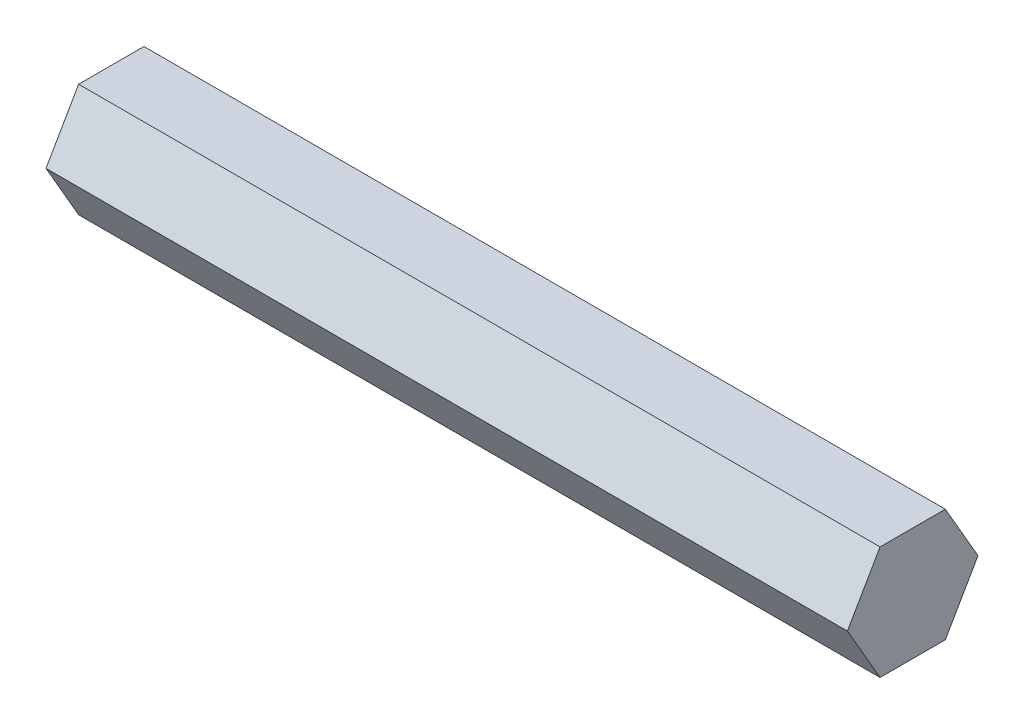
ISO-10303-21;
HEADER;
FILE_DESCRIPTION(('STEP AP214'),'2;1');
FILE_NAME('part.step','',(''),(''),'','','');
FILE_SCHEMA(('AUTOMOTIVE_DESIGN { 1 0 10303 214 1 1 1 1 }'));
ENDSEC;
DATA;
#1=APPLICATION_CONTEXT('core data for automotive mechanical design processes');
#2=APPLICATION_PROTOCOL_DEFINITION('international standard','automotive_design',2000,#1);
#3=PRODUCT_CONTEXT('',#1,'mechanical');
#4=PRODUCT('Part','Part','',(#3));
#5=PRODUCT_RELATED_PRODUCT_CATEGORY('part','',(#4));
#6=PRODUCT_DEFINITION_FORMATION('','',#4);
#7=PRODUCT_DEFINITION_CONTEXT('part definition',#1,'design');
#8=PRODUCT_DEFINITION('design','',#6,#7);
#9=PRODUCT_DEFINITION_SHAPE('','',#8);
#10=(LENGTH_UNIT() NAMED_UNIT(*) SI_UNIT(.MILLI.,.METRE.));
#11=(NAMED_UNIT(*) PLANE_ANGLE_UNIT() SI_UNIT($,.RADIAN.));
#12=(NAMED_UNIT(*) SI_UNIT($,.STERADIAN.) SOLID_ANGLE_UNIT());
#13=UNCERTAINTY_MEASURE_WITH_UNIT(LENGTH_MEASURE(1.E-05),#10,'distance_accuracy_value','');
#14=(GEOMETRIC_REPRESENTATION_CONTEXT(3) GLOBAL_UNCERTAINTY_ASSIGNED_CONTEXT((#13)) GLOBAL_UNIT_ASSIGNED_CONTEXT((#10,
#11,#12)) REPRESENTATION_CONTEXT('',''));
#15=CARTESIAN_POINT('',(0.,0.,0.));
#16=DIRECTION('',(0.,0.,1.));
#17=DIRECTION('',(1.,0.,0.));
#18=AXIS2_PLACEMENT_3D('',#15,#16,#17);
#19=CARTESIAN_POINT('',(90.,-6.34999999999996,-3.6661742093542));
#20=DIRECTION('',(0.,0.499999999999995,0.866025403784441));
#21=DIRECTION('',(0.,-0.866025403784442,0.499999999999995));
#22=AXIS2_PLACEMENT_3D('',#19,#20,#21);
#23=PLANE('',#22);
#24=DIRECTION('',(0.,0.866025403784442,-0.499999999999995));
#25=VECTOR('',#24,1.);
#26=CARTESIAN_POINT('',(0.,-6.34999999999996,-3.6661742093542));
#27=LINE('',#26,#25);
#28=CARTESIAN_POINT('',(0.,-6.34999999999996,-3.6661742093542));
#29=VERTEX_POINT('',#28);
#30=CARTESIAN_POINT('',(0.,0.,-7.33234841870825));
#31=VERTEX_POINT('',#30);
#32=EDGE_CURVE('E123',#29,#31,#27,.T.);
#33=ORIENTED_EDGE('',*,*,#32,.T.);
#34=DIRECTION('',(-1.,0.,0.));
#35=VECTOR('',#34,1.);
#36=CARTESIAN_POINT('',(90.,0.,-7.33234841870825));
#37=LINE('',#36,#35);
#38=CARTESIAN_POINT('',(90.,0.,-7.33234841870825));
#39=VERTEX_POINT('',#38);
#40=EDGE_CURVE('E11',#39,#31,#37,.T.);
#41=ORIENTED_EDGE('',*,*,#40,.F.);
#42=DIRECTION('',(0.,0.866025403784442,-0.499999999999995));
#43=VECTOR('',#42,1.);
#44=CARTESIAN_POINT('',(90.,-6.34999999999996,-3.6661742093542));
#45=LINE('',#44,#43);
#46=CARTESIAN_POINT('',(90.,-6.34999999999996,-3.6661742093542));
#47=VERTEX_POINT('',#46);
#48=EDGE_CURVE('E133',#47,#39,#45,.T.);
#49=ORIENTED_EDGE('',*,*,#48,.F.);
#50=DIRECTION('',(-1.,0.,0.));
#51=VECTOR('',#50,1.);
#52=CARTESIAN_POINT('',(90.,-6.34999999999996,-3.6661742093542));
#53=LINE('',#52,#51);
#54=EDGE_CURVE('E119',#47,#29,#53,.T.);
#55=ORIENTED_EDGE('',*,*,#54,.T.);
#56=EDGE_LOOP('',(#33,#41,#49,#55));
#57=FACE_BOUND('',#56,.T.);
#58=ADVANCED_FACE('F39',(#57),#23,.F.);
#59=CARTESIAN_POINT('',(90.,0.,-7.33234841870825));
#60=DIRECTION('',(0.,-0.500000000000001,0.866025403784438));
#61=DIRECTION('',(0.,-0.866025403784438,-0.500000000000001));
#62=AXIS2_PLACEMENT_3D('',#59,#60,#61);
#63=PLANE('',#62);
#64=DIRECTION('',(0.,0.866025403784438,0.500000000000001));
#65=VECTOR('',#64,1.);
#66=CARTESIAN_POINT('',(0.,0.,-7.33234841870825));
#67=LINE('',#66,#65);
#68=CARTESIAN_POINT('',(0.,6.35000000000001,-3.66617420935411));
#69=VERTEX_POINT('',#68);
#70=EDGE_CURVE('E126',#31,#69,#67,.T.);
#71=ORIENTED_EDGE('',*,*,#70,.T.);
#72=DIRECTION('',(-1.,0.,0.));
#73=VECTOR('',#72,1.);
#74=CARTESIAN_POINT('',(90.,6.35000000000001,-3.66617420935411));
#75=LINE('',#74,#73);
#76=CARTESIAN_POINT('',(90.,6.35000000000001,-3.66617420935411));
#77=VERTEX_POINT('',#76);
#78=EDGE_CURVE('E47',#77,#69,#75,.T.);
#79=ORIENTED_EDGE('',*,*,#78,.F.);
#80=DIRECTION('',(0.,0.866025403784438,0.500000000000001));
#81=VECTOR('',#80,1.);
#82=CARTESIAN_POINT('',(90.,0.,-7.33234841870825));
#83=LINE('',#82,#81);
#84=EDGE_CURVE('E92',#39,#77,#83,.T.);
#85=ORIENTED_EDGE('',*,*,#84,.F.);
#86=ORIENTED_EDGE('',*,*,#40,.T.);
#87=EDGE_LOOP('',(#71,#79,#85,#86));
#88=FACE_BOUND('',#87,.T.);
#89=ADVANCED_FACE('F157',(#88),#63,.F.);
#90=CARTESIAN_POINT('',(90.,6.35000000000001,-3.66617420935411));
#91=DIRECTION('',(0.,-1.,0.));
#92=DIRECTION('',(0.,0.,-1.));
#93=AXIS2_PLACEMENT_3D('',#90,#91,#92);
#94=PLANE('',#93);
#95=DIRECTION('',(0.,0.,1.));
#96=VECTOR('',#95,1.);
#97=CARTESIAN_POINT('',(0.,6.35000000000001,-3.66617420935411));
#98=LINE('',#97,#96);
#99=CARTESIAN_POINT('',(0.,6.34999999999999,3.66617420935415));
#100=VERTEX_POINT('',#99);
#101=EDGE_CURVE('E128',#69,#100,#98,.T.);
#102=ORIENTED_EDGE('',*,*,#101,.T.);
#103=DIRECTION('',(-1.,0.,0.));
#104=VECTOR('',#103,1.);
#105=CARTESIAN_POINT('',(90.,6.34999999999999,3.66617420935415));
#106=LINE('',#105,#104);
#107=CARTESIAN_POINT('',(90.,6.34999999999999,3.66617420935415));
#108=VERTEX_POINT('',#107);
#109=EDGE_CURVE('E114',#108,#100,#106,.T.);
#110=ORIENTED_EDGE('',*,*,#109,.F.);
#111=DIRECTION('',(0.,0.,1.));
#112=VECTOR('',#111,1.);
#113=CARTESIAN_POINT('',(90.,6.35000000000001,-3.66617420935411));
#114=LINE('',#113,#112);
#115=EDGE_CURVE('E105',#77,#108,#114,.T.);
#116=ORIENTED_EDGE('',*,*,#115,.F.);
#117=ORIENTED_EDGE('',*,*,#78,.T.);
#118=EDGE_LOOP('',(#102,#110,#116,#117));
#119=FACE_BOUND('',#118,.T.);
#120=ADVANCED_FACE('F139',(#119),#94,.F.);
#121=CARTESIAN_POINT('',(90.,6.34999999999999,3.66617420935415));
#122=DIRECTION('',(0.,-0.499999999999995,-0.866025403784442));
#123=DIRECTION('',(0.,0.866025403784442,-0.499999999999995));
#124=AXIS2_PLACEMENT_3D('',#121,#122,#123);
#125=PLANE('',#124);
#126=DIRECTION('',(0.,-0.866025403784442,0.499999999999995));
#127=VECTOR('',#126,1.);
#128=CARTESIAN_POINT('',(0.,6.34999999999999,3.66617420935415));
#129=LINE('',#128,#127);
#130=CARTESIAN_POINT('',(0.,0.,7.33234841870825));
#131=VERTEX_POINT('',#130);
#132=EDGE_CURVE('E113',#100,#131,#129,.T.);
#133=ORIENTED_EDGE('',*,*,#132,.T.);
#134=DIRECTION('',(-1.,0.,0.));
#135=VECTOR('',#134,1.);
#136=CARTESIAN_POINT('',(90.,0.,7.33234841870825));
#137=LINE('',#136,#135);
#138=CARTESIAN_POINT('',(90.,0.,7.33234841870825));
#139=VERTEX_POINT('',#138);
#140=EDGE_CURVE('E110',#139,#131,#137,.T.);
#141=ORIENTED_EDGE('',*,*,#140,.F.);
#142=DIRECTION('',(0.,-0.866025403784442,0.499999999999995));
#143=VECTOR('',#142,1.);
#144=CARTESIAN_POINT('',(90.,6.34999999999999,3.66617420935415));
#145=LINE('',#144,#143);
#146=EDGE_CURVE('E99',#108,#139,#145,.T.);
#147=ORIENTED_EDGE('',*,*,#146,.F.);
#148=ORIENTED_EDGE('',*,*,#109,.T.);
#149=EDGE_LOOP('',(#133,#141,#147,#148));
#150=FACE_BOUND('',#149,.T.);
#151=ADVANCED_FACE('F111',(#150),#125,.F.);
#152=CARTESIAN_POINT('',(90.,0.,7.33234841870825));
#153=DIRECTION('',(0.,0.500000000000007,-0.866025403784435));
#154=DIRECTION('',(0.,0.866025403784435,0.500000000000007));
#155=AXIS2_PLACEMENT_3D('',#152,#153,#154);
#156=PLANE('',#155);
#157=DIRECTION('',(0.,-0.866025403784434,-0.500000000000007));
#158=VECTOR('',#157,1.);
#159=CARTESIAN_POINT('',(0.,0.,7.33234841870825));
#160=LINE('',#159,#158);
#161=CARTESIAN_POINT('',(0.,-6.35000000000004,3.66617420935407));
#162=VERTEX_POINT('',#161);
#163=EDGE_CURVE('E78',#131,#162,#160,.T.);
#164=ORIENTED_EDGE('',*,*,#163,.T.);
#165=DIRECTION('',(-1.,0.,0.));
#166=VECTOR('',#165,1.);
#167=CARTESIAN_POINT('',(90.,-6.35000000000004,3.66617420935407));
#168=LINE('',#167,#166);
#169=CARTESIAN_POINT('',(90.,-6.35000000000004,3.66617420935407));
#170=VERTEX_POINT('',#169);
#171=EDGE_CURVE('E115',#170,#162,#168,.T.);
#172=ORIENTED_EDGE('',*,*,#171,.F.);
#173=DIRECTION('',(0.,-0.866025403784434,-0.500000000000007));
#174=VECTOR('',#173,1.);
#175=CARTESIAN_POINT('',(90.,0.,7.33234841870825));
#176=LINE('',#175,#174);
#177=EDGE_CURVE('E103',#139,#170,#176,.T.);
#178=ORIENTED_EDGE('',*,*,#177,.F.);
#179=ORIENTED_EDGE('',*,*,#140,.T.);
#180=EDGE_LOOP('',(#164,#172,#178,#179));
#181=FACE_BOUND('',#180,.T.);
#182=ADVANCED_FACE('F117',(#181),#156,.F.);
#183=CARTESIAN_POINT('',(90.,-6.35000000000004,3.66617420935407));
#184=DIRECTION('',(0.,1.,0.));
#185=DIRECTION('',(0.,0.,1.));
#186=AXIS2_PLACEMENT_3D('',#183,#184,#185);
#187=PLANE('',#186);
#188=DIRECTION('',(0.,0.,-1.));
#189=VECTOR('',#188,1.);
#190=CARTESIAN_POINT('',(0.,-6.35000000000004,3.66617420935407));
#191=LINE('',#190,#189);
#192=EDGE_CURVE('E84',#162,#29,#191,.T.);
#193=ORIENTED_EDGE('',*,*,#192,.T.);
#194=ORIENTED_EDGE('',*,*,#54,.F.);
#195=DIRECTION('',(0.,0.,-1.));
#196=VECTOR('',#195,1.);
#197=CARTESIAN_POINT('',(90.,-6.35000000000004,3.66617420935407));
#198=LINE('',#197,#196);
#199=EDGE_CURVE('E55',#170,#47,#198,.T.);
#200=ORIENTED_EDGE('',*,*,#199,.F.);
#201=ORIENTED_EDGE('',*,*,#171,.T.);
#202=EDGE_LOOP('',(#193,#194,#200,#201));
#203=FACE_BOUND('',#202,.T.);
#204=ADVANCED_FACE('F146',(#203),#187,.F.);
#205=CARTESIAN_POINT('',(90.,0.,0.));
#206=DIRECTION('',(1.,0.,0.));
#207=DIRECTION('',(0.,0.,-1.));
#208=AXIS2_PLACEMENT_3D('',#205,#206,#207);
#209=PLANE('',#208);
#210=ORIENTED_EDGE('',*,*,#48,.T.);
#211=ORIENTED_EDGE('',*,*,#84,.T.);
#212=ORIENTED_EDGE('',*,*,#115,.T.);
#213=ORIENTED_EDGE('',*,*,#146,.T.);
#214=ORIENTED_EDGE('',*,*,#177,.T.);
#215=ORIENTED_EDGE('',*,*,#199,.T.);
#216=EDGE_LOOP('',(#210,#211,#212,#213,#214,#215));
#217=FACE_BOUND('',#216,.T.);
#218=ADVANCED_FACE('F101',(#217),#209,.T.);
#219=CARTESIAN_POINT('',(0.,0.,0.));
#220=DIRECTION('',(1.,0.,0.));
#221=DIRECTION('',(0.,0.,-1.));
#222=AXIS2_PLACEMENT_3D('',#219,#220,#221);
#223=PLANE('',#222);
#224=ORIENTED_EDGE('',*,*,#32,.F.);
#225=ORIENTED_EDGE('',*,*,#192,.F.);
#226=ORIENTED_EDGE('',*,*,#163,.F.);
#227=ORIENTED_EDGE('',*,*,#132,.F.);
#228=ORIENTED_EDGE('',*,*,#101,.F.);
#229=ORIENTED_EDGE('',*,*,#70,.F.);
#230=EDGE_LOOP('',(#224,#225,#226,#227,#228,#229));
#231=FACE_BOUND('',#230,.T.);
#232=ADVANCED_FACE('F142',(#231),#223,.F.);
#233=CLOSED_SHELL('',(#58,#89,#120,#151,#182,#204,#218,#232));
#234=MANIFOLD_SOLID_BREP('B2',#233);
#235=ADVANCED_BREP_SHAPE_REPRESENTATION('',(#18,#234),#14);
#236=SHAPE_DEFINITION_REPRESENTATION(#9,#235);
ENDSEC;
END-ISO-10303-21;
